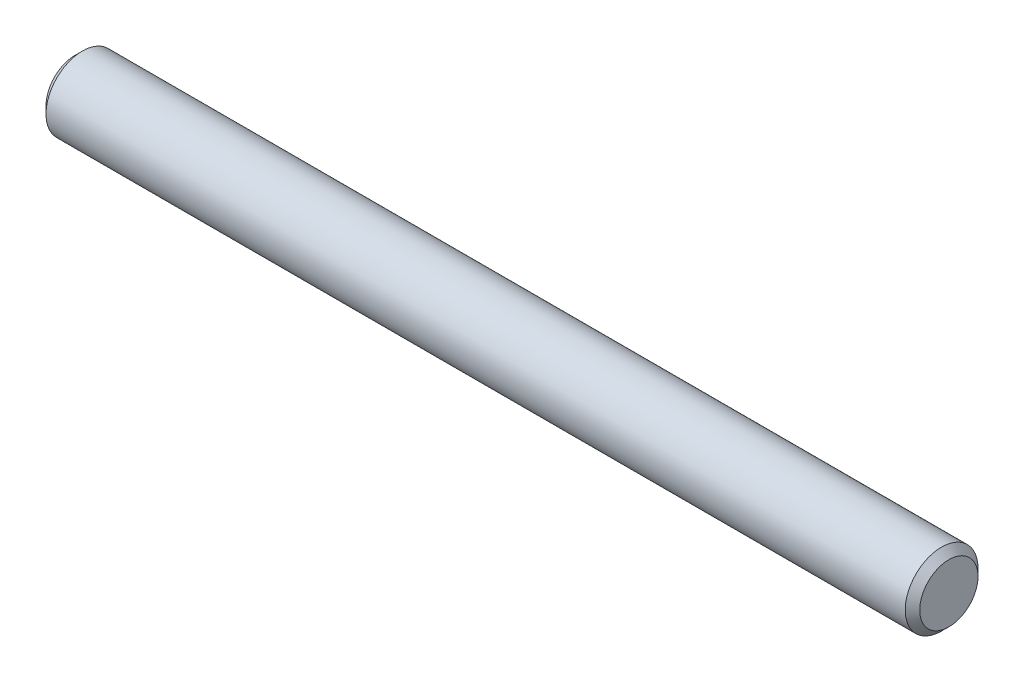
ISO-10303-21;
HEADER;
FILE_DESCRIPTION(('STEP AP214'),'2;1');
FILE_NAME('part.step','',(''),(''),'','','');
FILE_SCHEMA(('AUTOMOTIVE_DESIGN { 1 0 10303 214 1 1 1 1 }'));
ENDSEC;
DATA;
#1=APPLICATION_CONTEXT('core data for automotive mechanical design processes');
#2=APPLICATION_PROTOCOL_DEFINITION('international standard','automotive_design',2000,#1);
#3=PRODUCT_CONTEXT('',#1,'mechanical');
#4=PRODUCT('Part','Part','',(#3));
#5=PRODUCT_RELATED_PRODUCT_CATEGORY('part','',(#4));
#6=PRODUCT_DEFINITION_FORMATION('','',#4);
#7=PRODUCT_DEFINITION_CONTEXT('part definition',#1,'design');
#8=PRODUCT_DEFINITION('design','',#6,#7);
#9=PRODUCT_DEFINITION_SHAPE('','',#8);
#10=(LENGTH_UNIT() NAMED_UNIT(*) SI_UNIT(.MILLI.,.METRE.));
#11=(NAMED_UNIT(*) PLANE_ANGLE_UNIT() SI_UNIT($,.RADIAN.));
#12=(NAMED_UNIT(*) SI_UNIT($,.STERADIAN.) SOLID_ANGLE_UNIT());
#13=UNCERTAINTY_MEASURE_WITH_UNIT(LENGTH_MEASURE(1.E-05),#10,'distance_accuracy_value','');
#14=(GEOMETRIC_REPRESENTATION_CONTEXT(3) GLOBAL_UNCERTAINTY_ASSIGNED_CONTEXT((#13)) GLOBAL_UNIT_ASSIGNED_CONTEXT((#10,
#11,#12)) REPRESENTATION_CONTEXT('',''));
#15=CARTESIAN_POINT('',(0.,0.,0.));
#16=DIRECTION('',(0.,0.,1.));
#17=DIRECTION('',(1.,0.,0.));
#18=AXIS2_PLACEMENT_3D('',#15,#16,#17);
#19=CARTESIAN_POINT('',(-9.525,0.,0.));
#20=DIRECTION('',(1.,0.,0.));
#21=DIRECTION('',(0.,0.,-1.));
#22=AXIS2_PLACEMENT_3D('',#19,#20,#21);
#23=CYLINDRICAL_SURFACE('',#22,0.79375);
#24=CARTESIAN_POINT('',(9.36625,0.,0.));
#25=DIRECTION('',(1.,0.,0.));
#26=DIRECTION('',(0.,0.,-1.));
#27=AXIS2_PLACEMENT_3D('',#24,#25,#26);
#28=CIRCLE('',#27,0.79375);
#29=CARTESIAN_POINT('',(9.36625,0.,-0.79375));
#30=VERTEX_POINT('',#29);
#31=EDGE_CURVE('E37',#30,#30,#28,.F.);
#32=ORIENTED_EDGE('',*,*,#31,.T.);
#33=EDGE_LOOP('',(#32));
#34=FACE_BOUND('',#33,.T.);
#35=CARTESIAN_POINT('',(-9.36624999999999,0.,0.));
#36=DIRECTION('',(1.,0.,0.));
#37=DIRECTION('',(0.,0.,-1.));
#38=AXIS2_PLACEMENT_3D('',#35,#36,#37);
#39=CIRCLE('',#38,0.79375);
#40=CARTESIAN_POINT('',(-9.36624999999999,0.,-0.79375));
#41=VERTEX_POINT('',#40);
#42=EDGE_CURVE('E41',#41,#41,#39,.T.);
#43=ORIENTED_EDGE('',*,*,#42,.T.);
#44=EDGE_LOOP('',(#43));
#45=FACE_BOUND('',#44,.T.);
#46=ADVANCED_FACE('F30',(#34,#45),#23,.T.);
#47=CARTESIAN_POINT('',(-9.525,0.,0.));
#48=DIRECTION('',(1.,0.,0.));
#49=DIRECTION('',(0.,0.,-1.));
#50=AXIS2_PLACEMENT_3D('',#47,#48,#49);
#51=PLANE('',#50);
#52=CARTESIAN_POINT('',(-9.525,0.,0.));
#53=DIRECTION('',(1.,0.,0.));
#54=DIRECTION('',(0.,0.,-1.));
#55=AXIS2_PLACEMENT_3D('',#52,#53,#54);
#56=CIRCLE('',#55,0.634999999999988);
#57=CARTESIAN_POINT('',(-9.525,0.,-0.634999999999988));
#58=VERTEX_POINT('',#57);
#59=EDGE_CURVE('E10',#58,#58,#56,.F.);
#60=ORIENTED_EDGE('',*,*,#59,.T.);
#61=EDGE_LOOP('',(#60));
#62=FACE_BOUND('',#61,.T.);
#63=ADVANCED_FACE('F61',(#62),#51,.F.);
#64=CARTESIAN_POINT('',(9.525,0.,0.));
#65=DIRECTION('',(1.,0.,0.));
#66=DIRECTION('',(0.,0.,-1.));
#67=AXIS2_PLACEMENT_3D('',#64,#65,#66);
#68=PLANE('',#67);
#69=CARTESIAN_POINT('',(9.525,0.,0.));
#70=DIRECTION('',(1.,0.,0.));
#71=DIRECTION('',(0.,0.,-1.));
#72=AXIS2_PLACEMENT_3D('',#69,#70,#71);
#73=CIRCLE('',#72,0.635);
#74=CARTESIAN_POINT('',(9.525,0.,-0.635));
#75=VERTEX_POINT('',#74);
#76=EDGE_CURVE('E45',#75,#75,#73,.T.);
#77=ORIENTED_EDGE('',*,*,#76,.T.);
#78=EDGE_LOOP('',(#77));
#79=FACE_BOUND('',#78,.T.);
#80=ADVANCED_FACE('F51',(#79),#68,.T.);
#81=CARTESIAN_POINT('',(9.525,0.,0.));
#82=DIRECTION('',(-1.,0.,0.));
#83=DIRECTION('',(0.,0.,1.));
#84=AXIS2_PLACEMENT_3D('',#81,#82,#83);
#85=CONICAL_SURFACE('',#84,0.635,0.785398163397462);
#86=ORIENTED_EDGE('',*,*,#31,.F.);
#87=EDGE_LOOP('',(#86));
#88=FACE_BOUND('',#87,.T.);
#89=ORIENTED_EDGE('',*,*,#76,.F.);
#90=EDGE_LOOP('',(#89));
#91=FACE_BOUND('',#90,.T.);
#92=ADVANCED_FACE('F53',(#88,#91),#85,.T.);
#93=CARTESIAN_POINT('',(-9.36624999999999,0.,0.));
#94=DIRECTION('',(1.,0.,0.));
#95=DIRECTION('',(0.,0.,-1.));
#96=AXIS2_PLACEMENT_3D('',#93,#94,#95);
#97=CONICAL_SURFACE('',#96,0.79375,0.785398163397445);
#98=ORIENTED_EDGE('',*,*,#59,.F.);
#99=EDGE_LOOP('',(#98));
#100=FACE_BOUND('',#99,.T.);
#101=ORIENTED_EDGE('',*,*,#42,.F.);
#102=EDGE_LOOP('',(#101));
#103=FACE_BOUND('',#102,.T.);
#104=ADVANCED_FACE('F32',(#100,#103),#97,.T.);
#105=CLOSED_SHELL('',(#46,#63,#80,#92,#104));
#106=MANIFOLD_SOLID_BREP('B2',#105);
#107=ADVANCED_BREP_SHAPE_REPRESENTATION('',(#18,#106),#14);
#108=SHAPE_DEFINITION_REPRESENTATION(#9,#107);
ENDSEC;
END-ISO-10303-21;
